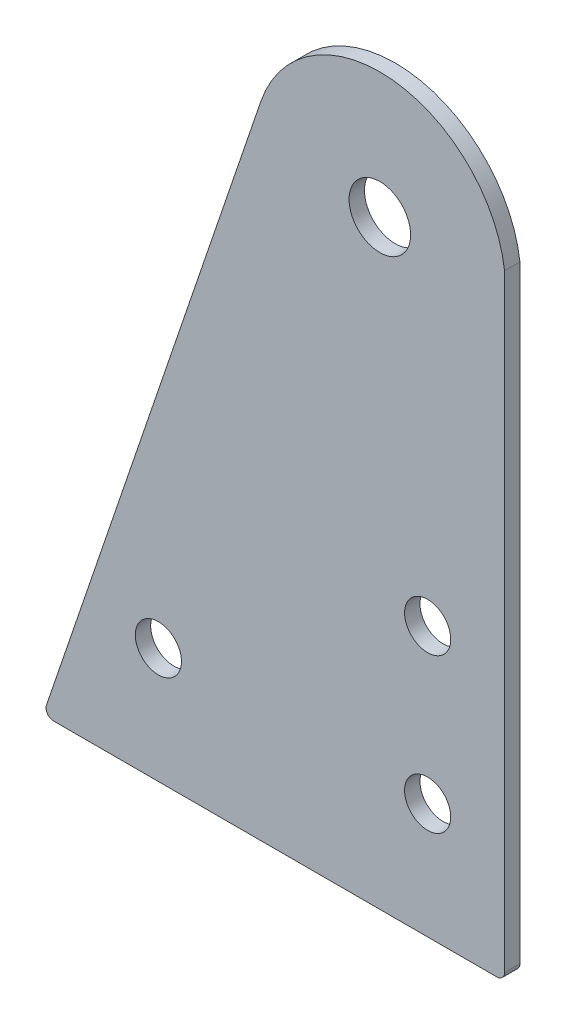
ISO-10303-21;
HEADER;
FILE_DESCRIPTION(('STEP AP214'),'2;1');
FILE_NAME('part.step','',(''),(''),'','','');
FILE_SCHEMA(('AUTOMOTIVE_DESIGN { 1 0 10303 214 1 1 1 1 }'));
ENDSEC;
DATA;
#1=APPLICATION_CONTEXT('core data for automotive mechanical design processes');
#2=APPLICATION_PROTOCOL_DEFINITION('international standard','automotive_design',2000,#1);
#3=PRODUCT_CONTEXT('',#1,'mechanical');
#4=PRODUCT('Part','Part','',(#3));
#5=PRODUCT_RELATED_PRODUCT_CATEGORY('part','',(#4));
#6=PRODUCT_DEFINITION_FORMATION('','',#4);
#7=PRODUCT_DEFINITION_CONTEXT('part definition',#1,'design');
#8=PRODUCT_DEFINITION('design','',#6,#7);
#9=PRODUCT_DEFINITION_SHAPE('','',#8);
#10=(LENGTH_UNIT() NAMED_UNIT(*) SI_UNIT(.MILLI.,.METRE.));
#11=(NAMED_UNIT(*) PLANE_ANGLE_UNIT() SI_UNIT($,.RADIAN.));
#12=(NAMED_UNIT(*) SI_UNIT($,.STERADIAN.) SOLID_ANGLE_UNIT());
#13=UNCERTAINTY_MEASURE_WITH_UNIT(LENGTH_MEASURE(1.E-05),#10,'distance_accuracy_value','');
#14=(GEOMETRIC_REPRESENTATION_CONTEXT(3) GLOBAL_UNCERTAINTY_ASSIGNED_CONTEXT((#13)) GLOBAL_UNIT_ASSIGNED_CONTEXT((#10,
#11,#12)) REPRESENTATION_CONTEXT('',''));
#15=CARTESIAN_POINT('',(0.,0.,0.));
#16=DIRECTION('',(0.,0.,1.));
#17=DIRECTION('',(1.,0.,0.));
#18=AXIS2_PLACEMENT_3D('',#15,#16,#17);
#19=CARTESIAN_POINT('',(0.,0.,2.));
#20=DIRECTION('',(-1.,0.,0.));
#21=DIRECTION('',(0.,0.,1.));
#22=AXIS2_PLACEMENT_3D('',#19,#20,#21);
#23=PLANE('',#22);
#24=DIRECTION('',(0.,1.,0.));
#25=VECTOR('',#24,1.);
#26=CARTESIAN_POINT('',(0.,0.,2.));
#27=LINE('',#26,#25);
#28=CARTESIAN_POINT('',(0.,1.,2.));
#29=VERTEX_POINT('',#28);
#30=CARTESIAN_POINT('',(0.,80.,2.));
#31=VERTEX_POINT('',#30);
#32=EDGE_CURVE('E88',#29,#31,#27,.T.);
#33=ORIENTED_EDGE('',*,*,#32,.F.);
#34=DIRECTION('',(0.,0.,-1.));
#35=VECTOR('',#34,1.);
#36=CARTESIAN_POINT('',(0.,1.,2.));
#37=LINE('',#36,#35);
#38=CARTESIAN_POINT('',(0.,1.,0.));
#39=VERTEX_POINT('',#38);
#40=EDGE_CURVE('E112',#29,#39,#37,.T.);
#41=ORIENTED_EDGE('',*,*,#40,.T.);
#42=DIRECTION('',(0.,1.,0.));
#43=VECTOR('',#42,1.);
#44=CARTESIAN_POINT('',(0.,0.,0.));
#45=LINE('',#44,#43);
#46=CARTESIAN_POINT('',(0.,80.,0.));
#47=VERTEX_POINT('',#46);
#48=EDGE_CURVE('E110',#39,#47,#45,.T.);
#49=ORIENTED_EDGE('',*,*,#48,.T.);
#50=DIRECTION('',(0.,0.,-1.));
#51=VECTOR('',#50,1.);
#52=CARTESIAN_POINT('',(0.,80.,2.));
#53=LINE('',#52,#51);
#54=EDGE_CURVE('E104',#31,#47,#53,.T.);
#55=ORIENTED_EDGE('',*,*,#54,.F.);
#56=EDGE_LOOP('',(#33,#41,#49,#55));
#57=FACE_BOUND('',#56,.T.);
#58=ADVANCED_FACE('F34',(#57),#23,.F.);
#59=CARTESIAN_POINT('',(-16.2149706208328,77.9312961356805,2.));
#60=DIRECTION('',(0.,0.,-1.));
#61=DIRECTION('',(-1.,0.,0.));
#62=AXIS2_PLACEMENT_3D('',#59,#60,#61);
#63=CYLINDRICAL_SURFACE('',#62,16.3464004573705);
#64=CARTESIAN_POINT('',(-16.2149706208328,77.9312961356805,0.));
#65=DIRECTION('',(0.,0.,1.));
#66=DIRECTION('',(1.,0.,0.));
#67=AXIS2_PLACEMENT_3D('',#64,#65,#66);
#68=CIRCLE('',#67,16.3464004573705);
#69=CARTESIAN_POINT('',(-31.6899927739787,83.1970816679982,0.));
#70=VERTEX_POINT('',#69);
#71=EDGE_CURVE('E138',#47,#70,#68,.T.);
#72=ORIENTED_EDGE('',*,*,#71,.T.);
#73=DIRECTION('',(0.,0.,-1.));
#74=VECTOR('',#73,1.);
#75=CARTESIAN_POINT('',(-31.6899927739787,83.1970816679982,2.));
#76=LINE('',#75,#74);
#77=CARTESIAN_POINT('',(-31.6899927739787,83.1970816679982,2.));
#78=VERTEX_POINT('',#77);
#79=EDGE_CURVE('E106',#78,#70,#76,.T.);
#80=ORIENTED_EDGE('',*,*,#79,.F.);
#81=CARTESIAN_POINT('',(-16.2149706208328,77.9312961356805,2.));
#82=DIRECTION('',(0.,0.,1.));
#83=DIRECTION('',(1.,0.,0.));
#84=AXIS2_PLACEMENT_3D('',#81,#82,#83);
#85=CIRCLE('',#84,16.3464004573705);
#86=EDGE_CURVE('E91',#31,#78,#85,.T.);
#87=ORIENTED_EDGE('',*,*,#86,.F.);
#88=ORIENTED_EDGE('',*,*,#54,.T.);
#89=EDGE_LOOP('',(#72,#80,#87,#88));
#90=FACE_BOUND('',#89,.T.);
#91=ADVANCED_FACE('F103',(#90),#63,.T.);
#92=CARTESIAN_POINT('',(-53.7736530665818,18.2979075270865,2.));
#93=DIRECTION('',(-0.946692955033307,0.322137313719327,0.));
#94=DIRECTION('',(-0.322137313719327,-0.946692955033307,0.));
#95=AXIS2_PLACEMENT_3D('',#92,#93,#94);
#96=PLANE('',#95);
#97=DIRECTION('',(0.322137313719327,0.946692955033308,0.));
#98=VECTOR('',#97,1.);
#99=CARTESIAN_POINT('',(-53.7736530665818,18.2979075270865,0.));
#100=LINE('',#99,#98);
#101=CARTESIAN_POINT('',(-59.5501078144237,1.32213731371932,0.));
#102=VERTEX_POINT('',#101);
#103=EDGE_CURVE('E136',#102,#70,#100,.T.);
#104=ORIENTED_EDGE('',*,*,#103,.F.);
#105=DIRECTION('',(0.,0.,-1.));
#106=VECTOR('',#105,1.);
#107=CARTESIAN_POINT('',(-59.5501078144237,1.32213731371933,2.));
#108=LINE('',#107,#106);
#109=CARTESIAN_POINT('',(-59.5501078144237,1.32213731371932,2.));
#110=VERTEX_POINT('',#109);
#111=EDGE_CURVE('E11',#102,#110,#108,.F.);
#112=ORIENTED_EDGE('',*,*,#111,.T.);
#113=DIRECTION('',(0.322137313719327,0.946692955033308,0.));
#114=VECTOR('',#113,1.);
#115=CARTESIAN_POINT('',(-53.7736530665818,18.2979075270865,2.));
#116=LINE('',#115,#114);
#117=EDGE_CURVE('E107',#110,#78,#116,.T.);
#118=ORIENTED_EDGE('',*,*,#117,.T.);
#119=ORIENTED_EDGE('',*,*,#79,.T.);
#120=EDGE_LOOP('',(#104,#112,#118,#119));
#121=FACE_BOUND('',#120,.T.);
#122=ADVANCED_FACE('F137',(#121),#96,.T.);
#123=CARTESIAN_POINT('',(0.,0.,2.));
#124=DIRECTION('',(0.,1.,0.));
#125=DIRECTION('',(0.,0.,1.));
#126=AXIS2_PLACEMENT_3D('',#123,#124,#125);
#127=PLANE('',#126);
#128=DIRECTION('',(1.,0.,0.));
#129=VECTOR('',#128,1.);
#130=CARTESIAN_POINT('',(0.,0.,0.));
#131=LINE('',#130,#129);
#132=CARTESIAN_POINT('',(-58.6034148593904,0.,0.));
#133=VERTEX_POINT('',#132);
#134=CARTESIAN_POINT('',(-1.,0.,0.));
#135=VERTEX_POINT('',#134);
#136=EDGE_CURVE('E98',#133,#135,#131,.T.);
#137=ORIENTED_EDGE('',*,*,#136,.T.);
#138=DIRECTION('',(0.,0.,-1.));
#139=VECTOR('',#138,1.);
#140=CARTESIAN_POINT('',(-1.,0.,2.));
#141=LINE('',#140,#139);
#142=CARTESIAN_POINT('',(-1.,0.,2.));
#143=VERTEX_POINT('',#142);
#144=EDGE_CURVE('E55',#135,#143,#141,.F.);
#145=ORIENTED_EDGE('',*,*,#144,.T.);
#146=DIRECTION('',(1.,0.,0.));
#147=VECTOR('',#146,1.);
#148=CARTESIAN_POINT('',(0.,0.,2.));
#149=LINE('',#148,#147);
#150=CARTESIAN_POINT('',(-58.6034148593904,0.,2.));
#151=VERTEX_POINT('',#150);
#152=EDGE_CURVE('E116',#151,#143,#149,.T.);
#153=ORIENTED_EDGE('',*,*,#152,.F.);
#154=DIRECTION('',(0.,0.,-1.));
#155=VECTOR('',#154,1.);
#156=CARTESIAN_POINT('',(-58.6034148593904,0.,0.));
#157=LINE('',#156,#155);
#158=EDGE_CURVE('E123',#151,#133,#157,.T.);
#159=ORIENTED_EDGE('',*,*,#158,.T.);
#160=EDGE_LOOP('',(#137,#145,#153,#159));
#161=FACE_BOUND('',#160,.T.);
#162=ADVANCED_FACE('F131',(#161),#127,.F.);
#163=CARTESIAN_POINT('',(0.,0.,2.));
#164=DIRECTION('',(0.,0.,1.));
#165=DIRECTION('',(1.,0.,0.));
#166=AXIS2_PLACEMENT_3D('',#163,#164,#165);
#167=PLANE('',#166);
#168=CARTESIAN_POINT('',(-10.,35.,2.));
#169=DIRECTION('',(0.,0.,1.));
#170=DIRECTION('',(1.,0.,0.));
#171=AXIS2_PLACEMENT_3D('',#168,#169,#170);
#172=CIRCLE('',#171,3.);
#173=CARTESIAN_POINT('',(-7.,35.,2.));
#174=VERTEX_POINT('',#173);
#175=EDGE_CURVE('E163',#174,#174,#172,.T.);
#176=ORIENTED_EDGE('',*,*,#175,.F.);
#177=EDGE_LOOP('',(#176));
#178=FACE_BOUND('',#177,.T.);
#179=CARTESIAN_POINT('',(-10.,15.,2.));
#180=DIRECTION('',(0.,0.,1.));
#181=DIRECTION('',(1.,0.,0.));
#182=AXIS2_PLACEMENT_3D('',#179,#180,#181);
#183=CIRCLE('',#182,3.);
#184=CARTESIAN_POINT('',(-7.,15.,2.));
#185=VERTEX_POINT('',#184);
#186=EDGE_CURVE('E157',#185,#185,#183,.T.);
#187=ORIENTED_EDGE('',*,*,#186,.F.);
#188=EDGE_LOOP('',(#187));
#189=FACE_BOUND('',#188,.T.);
#190=CARTESIAN_POINT('',(-45.,15.,2.));
#191=DIRECTION('',(0.,0.,1.));
#192=DIRECTION('',(1.,0.,0.));
#193=AXIS2_PLACEMENT_3D('',#190,#191,#192);
#194=CIRCLE('',#193,3.);
#195=CARTESIAN_POINT('',(-42.,15.,2.));
#196=VERTEX_POINT('',#195);
#197=EDGE_CURVE('E151',#196,#196,#194,.T.);
#198=ORIENTED_EDGE('',*,*,#197,.F.);
#199=EDGE_LOOP('',(#198));
#200=FACE_BOUND('',#199,.T.);
#201=CARTESIAN_POINT('',(-16.2149706208328,77.9312961356805,2.));
#202=DIRECTION('',(0.,0.,1.));
#203=DIRECTION('',(1.,0.,0.));
#204=AXIS2_PLACEMENT_3D('',#201,#202,#203);
#205=CIRCLE('',#204,4.);
#206=CARTESIAN_POINT('',(-12.2149706208328,77.9312961356805,2.));
#207=VERTEX_POINT('',#206);
#208=EDGE_CURVE('E145',#207,#207,#205,.T.);
#209=ORIENTED_EDGE('',*,*,#208,.F.);
#210=EDGE_LOOP('',(#209));
#211=FACE_BOUND('',#210,.T.);
#212=ORIENTED_EDGE('',*,*,#152,.T.);
#213=CARTESIAN_POINT('',(-1.,1.,2.));
#214=DIRECTION('',(0.,0.,1.));
#215=DIRECTION('',(1.,0.,0.));
#216=AXIS2_PLACEMENT_3D('',#213,#214,#215);
#217=CIRCLE('',#216,1.);
#218=EDGE_CURVE('E42',#143,#29,#217,.T.);
#219=ORIENTED_EDGE('',*,*,#218,.T.);
#220=ORIENTED_EDGE('',*,*,#32,.T.);
#221=ORIENTED_EDGE('',*,*,#86,.T.);
#222=ORIENTED_EDGE('',*,*,#117,.F.);
#223=CARTESIAN_POINT('',(-58.6034148593904,1.,2.));
#224=DIRECTION('',(0.,0.,1.));
#225=DIRECTION('',(1.,0.,0.));
#226=AXIS2_PLACEMENT_3D('',#223,#224,#225);
#227=CIRCLE('',#226,1.);
#228=EDGE_CURVE('E127',#110,#151,#227,.T.);
#229=ORIENTED_EDGE('',*,*,#228,.T.);
#230=EDGE_LOOP('',(#212,#219,#220,#221,#222,#229));
#231=FACE_BOUND('',#230,.T.);
#232=ADVANCED_FACE('F90',(#178,#189,#200,#211,#231),#167,.T.);
#233=CARTESIAN_POINT('',(0.,0.,0.));
#234=DIRECTION('',(0.,0.,1.));
#235=DIRECTION('',(1.,0.,0.));
#236=AXIS2_PLACEMENT_3D('',#233,#234,#235);
#237=PLANE('',#236);
#238=CARTESIAN_POINT('',(-10.,35.,0.));
#239=DIRECTION('',(0.,0.,1.));
#240=DIRECTION('',(1.,0.,0.));
#241=AXIS2_PLACEMENT_3D('',#238,#239,#240);
#242=CIRCLE('',#241,3.);
#243=CARTESIAN_POINT('',(-7.,35.,0.));
#244=VERTEX_POINT('',#243);
#245=EDGE_CURVE('E148',#244,#244,#242,.T.);
#246=ORIENTED_EDGE('',*,*,#245,.T.);
#247=EDGE_LOOP('',(#246));
#248=FACE_BOUND('',#247,.T.);
#249=CARTESIAN_POINT('',(-10.,15.,0.));
#250=DIRECTION('',(0.,0.,1.));
#251=DIRECTION('',(1.,0.,0.));
#252=AXIS2_PLACEMENT_3D('',#249,#250,#251);
#253=CIRCLE('',#252,3.);
#254=CARTESIAN_POINT('',(-7.,15.,0.));
#255=VERTEX_POINT('',#254);
#256=EDGE_CURVE('E160',#255,#255,#253,.T.);
#257=ORIENTED_EDGE('',*,*,#256,.T.);
#258=EDGE_LOOP('',(#257));
#259=FACE_BOUND('',#258,.T.);
#260=CARTESIAN_POINT('',(-45.,15.,0.));
#261=DIRECTION('',(0.,0.,1.));
#262=DIRECTION('',(1.,0.,0.));
#263=AXIS2_PLACEMENT_3D('',#260,#261,#262);
#264=CIRCLE('',#263,3.);
#265=CARTESIAN_POINT('',(-42.,15.,0.));
#266=VERTEX_POINT('',#265);
#267=EDGE_CURVE('E154',#266,#266,#264,.T.);
#268=ORIENTED_EDGE('',*,*,#267,.T.);
#269=EDGE_LOOP('',(#268));
#270=FACE_BOUND('',#269,.T.);
#271=CARTESIAN_POINT('',(-16.2149706208328,77.9312961356805,0.));
#272=DIRECTION('',(0.,0.,1.));
#273=DIRECTION('',(1.,0.,0.));
#274=AXIS2_PLACEMENT_3D('',#271,#272,#273);
#275=CIRCLE('',#274,4.);
#276=CARTESIAN_POINT('',(-12.2149706208328,77.9312961356805,0.));
#277=VERTEX_POINT('',#276);
#278=EDGE_CURVE('E142',#277,#277,#275,.T.);
#279=ORIENTED_EDGE('',*,*,#278,.T.);
#280=EDGE_LOOP('',(#279));
#281=FACE_BOUND('',#280,.T.);
#282=ORIENTED_EDGE('',*,*,#48,.F.);
#283=CARTESIAN_POINT('',(-1.,1.,0.));
#284=DIRECTION('',(0.,0.,1.));
#285=DIRECTION('',(1.,0.,0.));
#286=AXIS2_PLACEMENT_3D('',#283,#284,#285);
#287=CIRCLE('',#286,1.);
#288=EDGE_CURVE('E121',#39,#135,#287,.F.);
#289=ORIENTED_EDGE('',*,*,#288,.T.);
#290=ORIENTED_EDGE('',*,*,#136,.F.);
#291=CARTESIAN_POINT('',(-58.6034148593904,1.,0.));
#292=DIRECTION('',(0.,0.,1.));
#293=DIRECTION('',(1.,0.,0.));
#294=AXIS2_PLACEMENT_3D('',#291,#292,#293);
#295=CIRCLE('',#294,1.);
#296=EDGE_CURVE('E114',#133,#102,#295,.F.);
#297=ORIENTED_EDGE('',*,*,#296,.T.);
#298=ORIENTED_EDGE('',*,*,#103,.T.);
#299=ORIENTED_EDGE('',*,*,#71,.F.);
#300=EDGE_LOOP('',(#282,#289,#290,#297,#298,#299));
#301=FACE_BOUND('',#300,.T.);
#302=ADVANCED_FACE('F135',(#248,#259,#270,#281,#301),#237,.F.);
#303=CARTESIAN_POINT('',(-1.,1.,2.));
#304=DIRECTION('',(0.,0.,-1.));
#305=DIRECTION('',(-1.,0.,0.));
#306=AXIS2_PLACEMENT_3D('',#303,#304,#305);
#307=CYLINDRICAL_SURFACE('',#306,1.);
#308=ORIENTED_EDGE('',*,*,#218,.F.);
#309=ORIENTED_EDGE('',*,*,#144,.F.);
#310=ORIENTED_EDGE('',*,*,#288,.F.);
#311=ORIENTED_EDGE('',*,*,#40,.F.);
#312=EDGE_LOOP('',(#308,#309,#310,#311));
#313=FACE_BOUND('',#312,.T.);
#314=ADVANCED_FACE('F198',(#313),#307,.T.);
#315=CARTESIAN_POINT('',(-58.6034148593904,1.,2.));
#316=DIRECTION('',(0.,0.,1.));
#317=DIRECTION('',(1.,0.,0.));
#318=AXIS2_PLACEMENT_3D('',#315,#316,#317);
#319=CYLINDRICAL_SURFACE('',#318,1.);
#320=ORIENTED_EDGE('',*,*,#228,.F.);
#321=ORIENTED_EDGE('',*,*,#111,.F.);
#322=ORIENTED_EDGE('',*,*,#296,.F.);
#323=ORIENTED_EDGE('',*,*,#158,.F.);
#324=EDGE_LOOP('',(#320,#321,#322,#323));
#325=FACE_BOUND('',#324,.T.);
#326=ADVANCED_FACE('F36',(#325),#319,.T.);
#327=CARTESIAN_POINT('',(-16.2149706208328,77.9312961356805,0.));
#328=DIRECTION('',(0.,0.,1.));
#329=DIRECTION('',(1.,0.,0.));
#330=AXIS2_PLACEMENT_3D('',#327,#328,#329);
#331=CYLINDRICAL_SURFACE('',#330,4.);
#332=ORIENTED_EDGE('',*,*,#278,.F.);
#333=EDGE_LOOP('',(#332));
#334=FACE_BOUND('',#333,.T.);
#335=ORIENTED_EDGE('',*,*,#208,.T.);
#336=EDGE_LOOP('',(#335));
#337=FACE_BOUND('',#336,.T.);
#338=ADVANCED_FACE('F187',(#334,#337),#331,.F.);
#339=CARTESIAN_POINT('',(-45.,15.,0.));
#340=DIRECTION('',(0.,0.,1.));
#341=DIRECTION('',(1.,0.,0.));
#342=AXIS2_PLACEMENT_3D('',#339,#340,#341);
#343=CYLINDRICAL_SURFACE('',#342,3.);
#344=ORIENTED_EDGE('',*,*,#267,.F.);
#345=EDGE_LOOP('',(#344));
#346=FACE_BOUND('',#345,.T.);
#347=ORIENTED_EDGE('',*,*,#197,.T.);
#348=EDGE_LOOP('',(#347));
#349=FACE_BOUND('',#348,.T.);
#350=ADVANCED_FACE('F189',(#346,#349),#343,.F.);
#351=CARTESIAN_POINT('',(-10.,15.,0.));
#352=DIRECTION('',(0.,0.,1.));
#353=DIRECTION('',(1.,0.,0.));
#354=AXIS2_PLACEMENT_3D('',#351,#352,#353);
#355=CYLINDRICAL_SURFACE('',#354,3.);
#356=ORIENTED_EDGE('',*,*,#256,.F.);
#357=EDGE_LOOP('',(#356));
#358=FACE_BOUND('',#357,.T.);
#359=ORIENTED_EDGE('',*,*,#186,.T.);
#360=EDGE_LOOP('',(#359));
#361=FACE_BOUND('',#360,.T.);
#362=ADVANCED_FACE('F174',(#358,#361),#355,.F.);
#363=CARTESIAN_POINT('',(-10.,35.,0.));
#364=DIRECTION('',(0.,0.,1.));
#365=DIRECTION('',(1.,0.,0.));
#366=AXIS2_PLACEMENT_3D('',#363,#364,#365);
#367=CYLINDRICAL_SURFACE('',#366,3.);
#368=ORIENTED_EDGE('',*,*,#245,.F.);
#369=EDGE_LOOP('',(#368));
#370=FACE_BOUND('',#369,.T.);
#371=ORIENTED_EDGE('',*,*,#175,.T.);
#372=EDGE_LOOP('',(#371));
#373=FACE_BOUND('',#372,.T.);
#374=ADVANCED_FACE('F171',(#370,#373),#367,.F.);
#375=CLOSED_SHELL('',(#58,#91,#122,#162,#232,#302,#314,#326,#338,#350,#362,#374));
#376=MANIFOLD_SOLID_BREP('B2',#375);
#377=ADVANCED_BREP_SHAPE_REPRESENTATION('',(#18,#376),#14);
#378=SHAPE_DEFINITION_REPRESENTATION(#9,#377);
ENDSEC;
END-ISO-10303-21;
